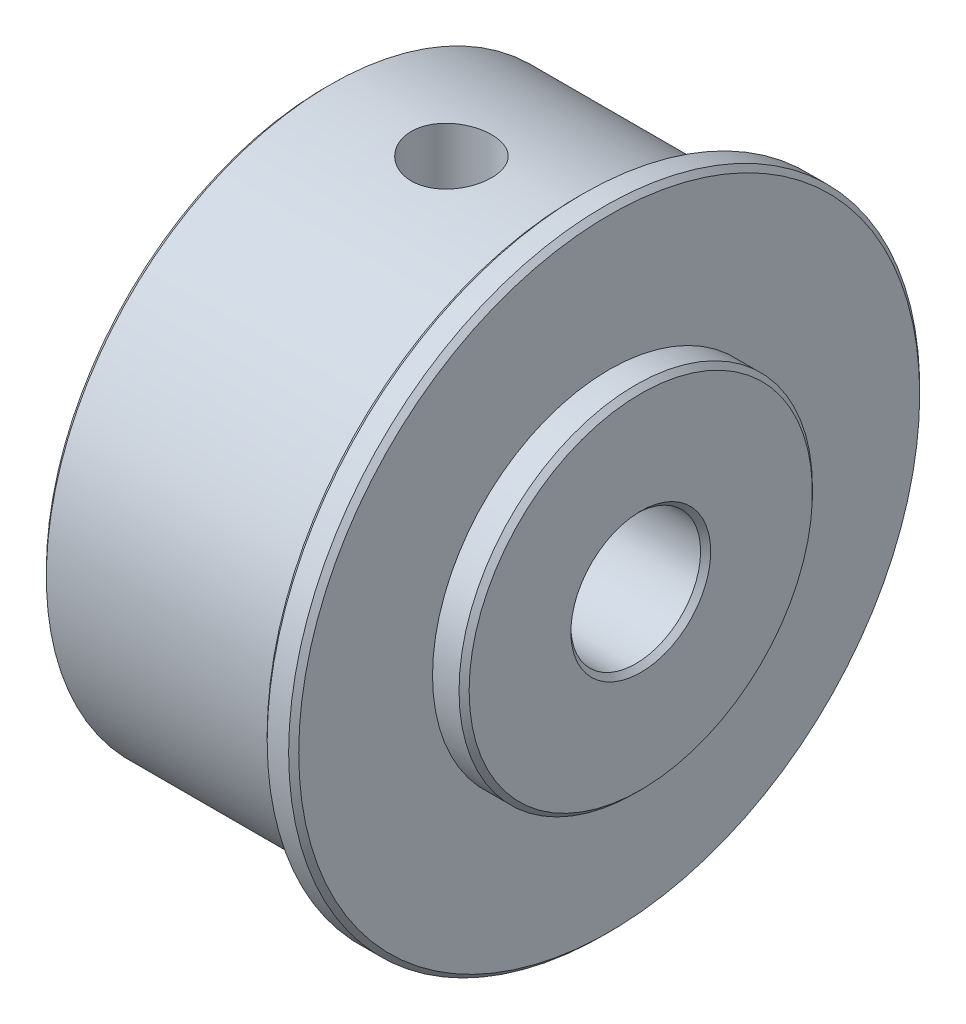
ISO-10303-21;
HEADER;
FILE_DESCRIPTION(('STEP AP214'),'2;1');
FILE_NAME('part.step','',(''),(''),'','','');
FILE_SCHEMA(('AUTOMOTIVE_DESIGN { 1 0 10303 214 1 1 1 1 }'));
ENDSEC;
DATA;
#1=APPLICATION_CONTEXT('core data for automotive mechanical design processes');
#2=APPLICATION_PROTOCOL_DEFINITION('international standard','automotive_design',2000,#1);
#3=PRODUCT_CONTEXT('',#1,'mechanical');
#4=PRODUCT('Part','Part','',(#3));
#5=PRODUCT_RELATED_PRODUCT_CATEGORY('part','',(#4));
#6=PRODUCT_DEFINITION_FORMATION('','',#4);
#7=PRODUCT_DEFINITION_CONTEXT('part definition',#1,'design');
#8=PRODUCT_DEFINITION('design','',#6,#7);
#9=PRODUCT_DEFINITION_SHAPE('','',#8);
#10=(LENGTH_UNIT() NAMED_UNIT(*) SI_UNIT(.MILLI.,.METRE.));
#11=(NAMED_UNIT(*) PLANE_ANGLE_UNIT() SI_UNIT($,.RADIAN.));
#12=(NAMED_UNIT(*) SI_UNIT($,.STERADIAN.) SOLID_ANGLE_UNIT());
#13=UNCERTAINTY_MEASURE_WITH_UNIT(LENGTH_MEASURE(1.E-05),#10,'distance_accuracy_value','');
#14=(GEOMETRIC_REPRESENTATION_CONTEXT(3) GLOBAL_UNCERTAINTY_ASSIGNED_CONTEXT((#13)) GLOBAL_UNIT_ASSIGNED_CONTEXT((#10,
#11,#12)) REPRESENTATION_CONTEXT('',''));
#15=CARTESIAN_POINT('',(0.,0.,0.));
#16=DIRECTION('',(0.,0.,1.));
#17=DIRECTION('',(1.,0.,0.));
#18=AXIS2_PLACEMENT_3D('',#15,#16,#17);
#19=CARTESIAN_POINT('',(1.5875,0.,0.));
#20=DIRECTION('',(1.,0.,0.));
#21=DIRECTION('',(0.,0.,-1.));
#22=AXIS2_PLACEMENT_3D('',#19,#20,#21);
#23=PLANE('',#22);
#24=CARTESIAN_POINT('',(1.5875,0.,0.));
#25=DIRECTION('',(-1.,0.,0.));
#26=DIRECTION('',(0.,0.,1.));
#27=AXIS2_PLACEMENT_3D('',#24,#25,#26);
#28=CIRCLE('',#27,8.89);
#29=CARTESIAN_POINT('',(1.5875,0.,8.89));
#30=VERTEX_POINT('',#29);
#31=EDGE_CURVE('E19',#30,#30,#28,.F.);
#32=ORIENTED_EDGE('',*,*,#31,.F.);
#33=EDGE_LOOP('',(#32));
#34=FACE_BOUND('',#33,.T.);
#35=CARTESIAN_POINT('',(1.5875,0.,0.));
#36=DIRECTION('',(-1.,0.,0.));
#37=DIRECTION('',(0.,0.,1.));
#38=AXIS2_PLACEMENT_3D('',#35,#36,#37);
#39=CIRCLE('',#38,15.621);
#40=CARTESIAN_POINT('',(1.5875,0.,15.621));
#41=VERTEX_POINT('',#40);
#42=EDGE_CURVE('E61',#41,#41,#39,.T.);
#43=ORIENTED_EDGE('',*,*,#42,.F.);
#44=EDGE_LOOP('',(#43));
#45=FACE_BOUND('',#44,.T.);
#46=ADVANCED_FACE('F16',(#34,#45),#23,.T.);
#47=CARTESIAN_POINT('',(3.175,0.,0.));
#48=DIRECTION('',(-1.,0.,0.));
#49=DIRECTION('',(0.,0.,1.));
#50=AXIS2_PLACEMENT_3D('',#47,#48,#49);
#51=CYLINDRICAL_SURFACE('',#50,8.89);
#52=ORIENTED_EDGE('',*,*,#31,.T.);
#53=EDGE_LOOP('',(#52));
#54=FACE_BOUND('',#53,.T.);
#55=CARTESIAN_POINT('',(2.92100000000001,0.,0.));
#56=DIRECTION('',(-1.,0.,0.));
#57=DIRECTION('',(0.,0.,1.));
#58=AXIS2_PLACEMENT_3D('',#55,#56,#57);
#59=CIRCLE('',#58,8.89);
#60=CARTESIAN_POINT('',(2.92100000000001,0.,8.89));
#61=VERTEX_POINT('',#60);
#62=EDGE_CURVE('E59',#61,#61,#59,.F.);
#63=ORIENTED_EDGE('',*,*,#62,.F.);
#64=EDGE_LOOP('',(#63));
#65=FACE_BOUND('',#64,.T.);
#66=ADVANCED_FACE('F124',(#54,#65),#51,.T.);
#67=CARTESIAN_POINT('',(1.3335,0.,0.));
#68=DIRECTION('',(-1.,0.,0.));
#69=DIRECTION('',(0.,0.,1.));
#70=AXIS2_PLACEMENT_3D('',#67,#68,#69);
#71=CONICAL_SURFACE('',#70,15.875,0.785398163397447);
#72=ORIENTED_EDGE('',*,*,#42,.T.);
#73=EDGE_LOOP('',(#72));
#74=FACE_BOUND('',#73,.T.);
#75=CARTESIAN_POINT('',(1.3335,0.,0.));
#76=DIRECTION('',(-1.,0.,0.));
#77=DIRECTION('',(0.,0.,1.));
#78=AXIS2_PLACEMENT_3D('',#75,#76,#77);
#79=CIRCLE('',#78,15.875);
#80=CARTESIAN_POINT('',(1.3335,0.,15.875));
#81=VERTEX_POINT('',#80);
#82=EDGE_CURVE('E56',#81,#81,#79,.T.);
#83=ORIENTED_EDGE('',*,*,#82,.F.);
#84=EDGE_LOOP('',(#83));
#85=FACE_BOUND('',#84,.T.);
#86=ADVANCED_FACE('F121',(#74,#85),#71,.T.);
#87=CARTESIAN_POINT('',(2.92100000000001,0.,0.));
#88=DIRECTION('',(-1.,0.,0.));
#89=DIRECTION('',(0.,0.,1.));
#90=AXIS2_PLACEMENT_3D('',#87,#88,#89);
#91=CONICAL_SURFACE('',#90,8.89,0.785398163397449);
#92=ORIENTED_EDGE('',*,*,#62,.T.);
#93=EDGE_LOOP('',(#92));
#94=FACE_BOUND('',#93,.T.);
#95=CARTESIAN_POINT('',(3.175,0.,0.));
#96=DIRECTION('',(-1.,0.,0.));
#97=DIRECTION('',(0.,0.,1.));
#98=AXIS2_PLACEMENT_3D('',#95,#96,#97);
#99=CIRCLE('',#98,8.636);
#100=CARTESIAN_POINT('',(3.175,0.,8.636));
#101=VERTEX_POINT('',#100);
#102=EDGE_CURVE('E55',#101,#101,#99,.F.);
#103=ORIENTED_EDGE('',*,*,#102,.F.);
#104=EDGE_LOOP('',(#103));
#105=FACE_BOUND('',#104,.T.);
#106=ADVANCED_FACE('F117',(#94,#105),#91,.T.);
#107=CARTESIAN_POINT('',(1.5875,0.,0.));
#108=DIRECTION('',(-1.,0.,0.));
#109=DIRECTION('',(0.,0.,1.));
#110=AXIS2_PLACEMENT_3D('',#107,#108,#109);
#111=CYLINDRICAL_SURFACE('',#110,15.875);
#112=ORIENTED_EDGE('',*,*,#82,.T.);
#113=EDGE_LOOP('',(#112));
#114=FACE_BOUND('',#113,.T.);
#115=CARTESIAN_POINT('',(0.253999999999997,0.,0.));
#116=DIRECTION('',(1.,0.,0.));
#117=DIRECTION('',(0.,0.,-1.));
#118=AXIS2_PLACEMENT_3D('',#115,#116,#117);
#119=CIRCLE('',#118,15.875);
#120=CARTESIAN_POINT('',(0.253999999999997,0.,-15.875));
#121=VERTEX_POINT('',#120);
#122=EDGE_CURVE('E48',#121,#121,#119,.F.);
#123=ORIENTED_EDGE('',*,*,#122,.F.);
#124=EDGE_LOOP('',(#123));
#125=FACE_BOUND('',#124,.T.);
#126=ADVANCED_FACE('F113',(#114,#125),#111,.T.);
#127=CARTESIAN_POINT('',(3.175,0.,0.));
#128=DIRECTION('',(1.,0.,0.));
#129=DIRECTION('',(0.,0.,-1.));
#130=AXIS2_PLACEMENT_3D('',#127,#128,#129);
#131=PLANE('',#130);
#132=ORIENTED_EDGE('',*,*,#102,.T.);
#133=EDGE_LOOP('',(#132));
#134=FACE_BOUND('',#133,.T.);
#135=CARTESIAN_POINT('',(3.17500000005566,0.,0.));
#136=DIRECTION('',(1.,0.,0.));
#137=DIRECTION('',(0.,0.,-1.));
#138=AXIS2_PLACEMENT_3D('',#135,#136,#137);
#139=CIRCLE('',#138,3.51790000001984);
#140=CARTESIAN_POINT('',(3.17500000005566,0.,-3.51790000001984));
#141=VERTEX_POINT('',#140);
#142=EDGE_CURVE('E42',#141,#141,#139,.F.);
#143=ORIENTED_EDGE('',*,*,#142,.T.);
#144=EDGE_LOOP('',(#143));
#145=FACE_BOUND('',#144,.T.);
#146=ADVANCED_FACE('F35',(#134,#145),#131,.T.);
#147=CARTESIAN_POINT('',(-6.35,6.33729999992738,0.));
#148=DIRECTION('',(0.,1.,0.));
#149=DIRECTION('',(0.,0.,1.));
#150=AXIS2_PLACEMENT_3D('',#147,#148,#149);
#151=CONICAL_SURFACE('',#150,2.0192999998585,1.02974425857673);
#152=CARTESIAN_POINT('',(-6.35,5.12398215195731,5.68441965115255E-11));
#153=VERTEX_POINT('',#152);
#154=VERTEX_LOOP('',#153);
#155=FACE_BOUND('',#154,.T.);
#156=CARTESIAN_POINT('',(-6.35,6.3373,0.));
#157=DIRECTION('',(0.,1.,0.));
#158=DIRECTION('',(0.,0.,1.));
#159=AXIS2_PLACEMENT_3D('',#156,#157,#158);
#160=CIRCLE('',#159,2.01929999999999);
#161=CARTESIAN_POINT('',(-6.35,6.3373,2.01929999999999));
#162=VERTEX_POINT('',#161);
#163=EDGE_CURVE('E39',#162,#162,#160,.T.);
#164=ORIENTED_EDGE('',*,*,#163,.T.);
#165=EDGE_LOOP('',(#164));
#166=FACE_BOUND('',#165,.T.);
#167=ADVANCED_FACE('F31',(#155,#166),#151,.F.);
#168=CARTESIAN_POINT('',(0.253999999999997,0.,0.));
#169=DIRECTION('',(1.,0.,0.));
#170=DIRECTION('',(0.,0.,-1.));
#171=AXIS2_PLACEMENT_3D('',#168,#169,#170);
#172=CONICAL_SURFACE('',#171,15.875,0.785398163397462);
#173=CARTESIAN_POINT('',(0.,0.,0.));
#174=DIRECTION('',(1.,0.,0.));
#175=DIRECTION('',(0.,0.,-1.));
#176=AXIS2_PLACEMENT_3D('',#173,#174,#175);
#177=CIRCLE('',#176,15.621);
#178=CARTESIAN_POINT('',(0.,0.,-15.621));
#179=VERTEX_POINT('',#178);
#180=EDGE_CURVE('E41',#179,#179,#177,.T.);
#181=ORIENTED_EDGE('',*,*,#180,.T.);
#182=EDGE_LOOP('',(#181));
#183=FACE_BOUND('',#182,.T.);
#184=ORIENTED_EDGE('',*,*,#122,.T.);
#185=EDGE_LOOP('',(#184));
#186=FACE_BOUND('',#185,.T.);
#187=ADVANCED_FACE('F34',(#183,#186),#172,.T.);
#188=CARTESIAN_POINT('',(-6.35,-6.33729999992738,0.));
#189=DIRECTION('',(0.,-1.,0.));
#190=DIRECTION('',(0.,0.,-1.));
#191=AXIS2_PLACEMENT_3D('',#188,#189,#190);
#192=CONICAL_SURFACE('',#191,2.0192999998585,1.02974425857673);
#193=CARTESIAN_POINT('',(-6.35,-5.12398215195731,-5.68426412100906E-11));
#194=VERTEX_POINT('',#193);
#195=VERTEX_LOOP('',#194);
#196=FACE_BOUND('',#195,.T.);
#197=CARTESIAN_POINT('',(-6.35,-6.3373,0.));
#198=DIRECTION('',(0.,-1.,0.));
#199=DIRECTION('',(0.,0.,-1.));
#200=AXIS2_PLACEMENT_3D('',#197,#198,#199);
#201=CIRCLE('',#200,2.01929999999999);
#202=CARTESIAN_POINT('',(-6.35,-6.3373,-2.01929999999999));
#203=VERTEX_POINT('',#202);
#204=EDGE_CURVE('E45',#203,#203,#201,.T.);
#205=ORIENTED_EDGE('',*,*,#204,.T.);
#206=EDGE_LOOP('',(#205));
#207=FACE_BOUND('',#206,.T.);
#208=ADVANCED_FACE('F104',(#196,#207),#192,.F.);
#209=CARTESIAN_POINT('',(3.17500000005566,0.,0.));
#210=DIRECTION('',(1.,0.,0.));
#211=DIRECTION('',(0.,0.,-1.));
#212=AXIS2_PLACEMENT_3D('',#209,#210,#211);
#213=CONICAL_SURFACE('',#212,3.51790000001984,0.785398163285552);
#214=ORIENTED_EDGE('',*,*,#142,.F.);
#215=EDGE_LOOP('',(#214));
#216=FACE_BOUND('',#215,.T.);
#217=CARTESIAN_POINT('',(2.921,0.,0.));
#218=DIRECTION('',(1.,0.,0.));
#219=DIRECTION('',(0.,0.,-1.));
#220=AXIS2_PLACEMENT_3D('',#217,#218,#219);
#221=CIRCLE('',#220,3.2639);
#222=CARTESIAN_POINT('',(2.921,0.,-3.2639));
#223=VERTEX_POINT('',#222);
#224=EDGE_CURVE('E94',#223,#223,#221,.F.);
#225=ORIENTED_EDGE('',*,*,#224,.T.);
#226=EDGE_LOOP('',(#225));
#227=FACE_BOUND('',#226,.T.);
#228=ADVANCED_FACE('F100',(#216,#227),#213,.F.);
#229=CARTESIAN_POINT('',(-6.35,14.2875,0.));
#230=DIRECTION('',(0.,1.,0.));
#231=DIRECTION('',(0.,0.,1.));
#232=AXIS2_PLACEMENT_3D('',#229,#230,#231);
#233=CYLINDRICAL_SURFACE('',#232,2.01929999999999);
#234=CARTESIAN_POINT('',(-6.35,14.144082994666,2.01929999999999));
#235=CARTESIAN_POINT('',(-6.46270978043252,14.1440848572454,2.01929494830352));
#236=CARTESIAN_POINT('',(-6.57556587894467,14.1454458805024,2.00982386080186));
#237=CARTESIAN_POINT('',(-6.7982088924763,14.1507430375104,1.97217534297388));
#238=CARTESIAN_POINT('',(-6.90798898861305,14.1546844828974,1.94395932562443));
#239=CARTESIAN_POINT('',(-7.12110470893202,14.1646874218911,1.8696741044343));
#240=CARTESIAN_POINT('',(-7.22444753490229,14.1707464942905,1.82362528341692));
#241=CARTESIAN_POINT('',(-7.42189406589666,14.1842985714464,1.71502478847225));
#242=CARTESIAN_POINT('',(-7.51600143849081,14.1917910034744,1.6524797022028));
#243=CARTESIAN_POINT('',(-7.69303462417489,14.2074272342722,1.51217328150928));
#244=CARTESIAN_POINT('',(-7.77588421230663,14.2155749310997,1.43431618488559));
#245=CARTESIAN_POINT('',(-7.92739205174378,14.2315690971988,1.2657989315602));
#246=CARTESIAN_POINT('',(-7.99604883392367,14.2394155352181,1.17513745108457));
#247=CARTESIAN_POINT('',(-8.11749018201473,14.2539623529557,0.983112202140053));
#248=CARTESIAN_POINT('',(-8.1702063573829,14.2606577427863,0.881704771543284));
#249=CARTESIAN_POINT('',(-8.25783082400248,14.2721058154367,0.671365971979825));
#250=CARTESIAN_POINT('',(-8.29274010812396,14.2768586065682,0.56243502289132));
#251=CARTESIAN_POINT('',(-8.34353419968075,14.2838590054793,0.340911595459712));
#252=CARTESIAN_POINT('',(-8.35954437028774,14.28612311441,0.228348392070305));
#253=CARTESIAN_POINT('',(-8.37247474096552,14.2879475293366,0.00211168387442576));
#254=CARTESIAN_POINT('',(-8.36939585590122,14.2875079649092,-0.111561767461443));
#255=CARTESIAN_POINT('',(-8.34433505905639,14.2839878101692,-0.335936542663665));
#256=CARTESIAN_POINT('',(-8.32248816809108,14.2809260846932,-0.446653285103087));
#257=CARTESIAN_POINT('',(-8.26072280300443,14.272526639762,-0.662834215513372));
#258=CARTESIAN_POINT('',(-8.2208037520711,14.2671888476616,-0.768298235713001));
#259=CARTESIAN_POINT('',(-8.12388550625377,14.2548043308748,-0.971394358653125));
#260=CARTESIAN_POINT('',(-8.06682832552566,14.247751820225,-1.06899842301094));
#261=CARTESIAN_POINT('',(-7.93730058817926,14.2327257552402,-1.25328969037924));
#262=CARTESIAN_POINT('',(-7.86483035509148,14.2247522202398,-1.3399771224765));
#263=CARTESIAN_POINT('',(-7.70579446431181,14.2086932563854,-1.5007629286406));
#264=CARTESIAN_POINT('',(-7.61911362555077,14.200607453654,-1.57474736975061));
#265=CARTESIAN_POINT('',(-7.43445909511833,14.1852981969896,-1.70717057678363));
#266=CARTESIAN_POINT('',(-7.3364802927051,14.1780751363578,-1.76560226741946));
#267=CARTESIAN_POINT('',(-7.13187256086239,14.1653086919635,-1.8652679033142));
#268=CARTESIAN_POINT('',(-7.02523133128519,14.1597677514924,-1.90647686483089));
#269=CARTESIAN_POINT('',(-6.80658871275593,14.1510314499486,-1.97028383212601));
#270=CARTESIAN_POINT('',(-6.69459920164276,14.1478311271646,-1.99292121896487));
#271=CARTESIAN_POINT('',(-6.5431885987086,14.1453494339129,-2.0104117344966));
#272=CARTESIAN_POINT('',(-6.5046324531641,14.1448755243254,-2.0137422538627));
#273=CARTESIAN_POINT('',(-6.42738995630406,14.1442419848102,-2.01818725463624));
#274=CARTESIAN_POINT('',(-6.38870360491022,14.1440823550717,-2.01930173471071));
#275=CARTESIAN_POINT('',(-6.23729021956748,14.1440848572454,-2.01929494830352));
#276=CARTESIAN_POINT('',(-6.12443412105533,14.1454458805024,-2.00982386080186));
#277=CARTESIAN_POINT('',(-5.9017911075237,14.1507430375104,-1.97217534297388));
#278=CARTESIAN_POINT('',(-5.79201101138695,14.1546844828974,-1.94395932562443));
#279=CARTESIAN_POINT('',(-5.57889529106798,14.1646874218911,-1.86967410443429));
#280=CARTESIAN_POINT('',(-5.47555246509771,14.1707464942905,-1.82362528341692));
#281=CARTESIAN_POINT('',(-5.27810593410334,14.1842985714464,-1.71502478847225));
#282=CARTESIAN_POINT('',(-5.18399856150919,14.1917910034744,-1.6524797022028));
#283=CARTESIAN_POINT('',(-5.00696537582511,14.2074272342722,-1.51217328150928));
#284=CARTESIAN_POINT('',(-4.92411578769338,14.2155749310997,-1.43431618488559));
#285=CARTESIAN_POINT('',(-4.77260794825623,14.2315690971988,-1.26579893156019));
#286=CARTESIAN_POINT('',(-4.70395116607633,14.2394155352181,-1.17513745108457));
#287=CARTESIAN_POINT('',(-4.58250981798527,14.2539623529557,-0.983112202140051));
#288=CARTESIAN_POINT('',(-4.5297936426171,14.2606577427863,-0.881704771543283));
#289=CARTESIAN_POINT('',(-4.44216917599753,14.2721058154367,-0.671365971979824));
#290=CARTESIAN_POINT('',(-4.40725989187604,14.2768586065682,-0.562435022891319));
#291=CARTESIAN_POINT('',(-4.35646580031926,14.2838590054793,-0.34091159545971));
#292=CARTESIAN_POINT('',(-4.34045562971226,14.28612311441,-0.228348392070304));
#293=CARTESIAN_POINT('',(-4.32752525903448,14.2879475293366,-0.00211168387442461));
#294=CARTESIAN_POINT('',(-4.33060414409879,14.2875079649092,0.111561767461445));
#295=CARTESIAN_POINT('',(-4.35566494094361,14.2839878101692,0.335936542663667));
#296=CARTESIAN_POINT('',(-4.37751183190892,14.2809260846932,0.446653285103088));
#297=CARTESIAN_POINT('',(-4.43927719699557,14.272526639762,0.662834215513374));
#298=CARTESIAN_POINT('',(-4.4791962479289,14.2671888476616,0.768298235713002));
#299=CARTESIAN_POINT('',(-4.57611449374623,14.2548043308748,0.971394358653127));
#300=CARTESIAN_POINT('',(-4.63317167447434,14.247751820225,1.06899842301094));
#301=CARTESIAN_POINT('',(-4.76269941182075,14.2327257552402,1.25328969037924));
#302=CARTESIAN_POINT('',(-4.83516964490852,14.2247522202398,1.3399771224765));
#303=CARTESIAN_POINT('',(-4.99420553568819,14.2086932563854,1.5007629286406));
#304=CARTESIAN_POINT('',(-5.08088637444923,14.200607453654,1.57474736975061));
#305=CARTESIAN_POINT('',(-5.26554090488167,14.1852981969896,1.70717057678363));
#306=CARTESIAN_POINT('',(-5.3635197072949,14.1780751363578,1.76560226741946));
#307=CARTESIAN_POINT('',(-5.56812743913762,14.1653086919635,1.8652679033142));
#308=CARTESIAN_POINT('',(-5.67476866871481,14.1597677514924,1.90647686483089));
#309=CARTESIAN_POINT('',(-5.89341128724408,14.1510314499486,1.97028383212602));
#310=CARTESIAN_POINT('',(-6.00540079835724,14.1478311271646,1.99292121896487));
#311=CARTESIAN_POINT('',(-6.1568114012914,14.1453494339129,2.01041173449661));
#312=CARTESIAN_POINT('',(-6.19536754683591,14.1448755243254,2.0137422538627));
#313=CARTESIAN_POINT('',(-6.27261004369595,14.1442419848102,2.01818725463624));
#314=CARTESIAN_POINT('',(-6.31129639508978,14.1440823550717,2.01930173471071));
#315=CARTESIAN_POINT('',(-6.35,14.144082994666,2.01929999999999));
#316=B_SPLINE_CURVE_WITH_KNOTS('',3,(#234,#235,#236,#237,#238,#239,#240,#241,#242,#243,#244,
#245,#246,#247,#248,#249,#250,#251,#252,#253,#254,#255,#256,#257,#258,#259,#260,#261,#262,#263,
#264,#265,#266,#267,#268,#269,#270,#271,#272,#273,#274,#275,#276,#277,#278,#279,#280,#281,#282,
#283,#284,#285,#286,#287,#288,#289,#290,#291,#292,#293,#294,#295,#296,#297,#298,#299,#300,#301,
#302,#303,#304,#305,#306,#307,#308,#309,#310,#311,#312,#313,#314,#315),.UNSPECIFIED.,.T.,.F.,(4,
2,2,2,2,2,2,2,2,2,2,2,2,2,2,2,2,2,2,2,2,2,2,2,2,2,2,2,2,2,2,2,2,2,2,2,2,2,2,2,4),(0.,
0.337981725405059,0.676661361564413,1.01495502540221,1.35311379825344,1.69345884511455,
2.03383910414603,2.37565963920306,2.71746111307282,3.05698234773836,3.39648731058473,
3.73357006716555,4.07066358322854,4.40891073452933,4.74715078649165,5.08828181598833,
5.42956776925377,5.77134709676019,6.11239979348321,6.22845984832776,6.34451997298378,
6.68250169838884,7.0211813345482,7.35947499838599,7.69763377123723,8.03797881809834,
8.37835907712982,8.72017961218684,9.0619810860566,9.40150232072215,9.74100728356851,
10.0780900401493,10.4151835562123,10.7534307075131,11.0916707594754,11.4328017889721,
11.7740877422376,12.115867069744,12.456919766467,12.5729798213115,12.6890399459676),.UNSPECIFIED.);
#317=CARTESIAN_POINT('',(-6.35,14.144082994666,2.01929999999999));
#318=VERTEX_POINT('',#317);
#319=EDGE_CURVE('E89',#318,#318,#316,.T.);
#320=ORIENTED_EDGE('',*,*,#319,.F.);
#321=EDGE_LOOP('',(#320));
#322=FACE_BOUND('',#321,.T.);
#323=ORIENTED_EDGE('',*,*,#163,.F.);
#324=EDGE_LOOP('',(#323));
#325=FACE_BOUND('',#324,.T.);
#326=ADVANCED_FACE('F95',(#322,#325),#233,.F.);
#327=CARTESIAN_POINT('',(0.,0.,0.));
#328=DIRECTION('',(1.,0.,0.));
#329=DIRECTION('',(0.,0.,-1.));
#330=AXIS2_PLACEMENT_3D('',#327,#328,#329);
#331=PLANE('',#330);
#332=CARTESIAN_POINT('',(0.,0.,0.));
#333=DIRECTION('',(1.,0.,0.));
#334=DIRECTION('',(0.,0.,-1.));
#335=AXIS2_PLACEMENT_3D('',#332,#333,#334);
#336=CIRCLE('',#335,14.2875);
#337=CARTESIAN_POINT('',(0.,0.,-14.2875));
#338=VERTEX_POINT('',#337);
#339=EDGE_CURVE('E74',#338,#338,#336,.F.);
#340=ORIENTED_EDGE('',*,*,#339,.F.);
#341=EDGE_LOOP('',(#340));
#342=FACE_BOUND('',#341,.T.);
#343=ORIENTED_EDGE('',*,*,#180,.F.);
#344=EDGE_LOOP('',(#343));
#345=FACE_BOUND('',#344,.T.);
#346=ADVANCED_FACE('F99',(#342,#345),#331,.F.);
#347=CARTESIAN_POINT('',(-6.35,-14.2875,0.));
#348=DIRECTION('',(0.,-1.,0.));
#349=DIRECTION('',(0.,0.,-1.));
#350=AXIS2_PLACEMENT_3D('',#347,#348,#349);
#351=CYLINDRICAL_SURFACE('',#350,2.01929999999999);
#352=CARTESIAN_POINT('',(-6.35,-14.144082994666,-2.01929999999999));
#353=CARTESIAN_POINT('',(-6.46270978043252,-14.1440848572454,-2.01929494830352));
#354=CARTESIAN_POINT('',(-6.57556587894467,-14.1454458805024,-2.00982386080186));
#355=CARTESIAN_POINT('',(-6.7982088924763,-14.1507430375104,-1.97217534297388));
#356=CARTESIAN_POINT('',(-6.90798898861305,-14.1546844828974,-1.94395932562443));
#357=CARTESIAN_POINT('',(-7.12110470893202,-14.1646874218911,-1.86967410443429));
#358=CARTESIAN_POINT('',(-7.22444753490229,-14.1707464942905,-1.82362528341692));
#359=CARTESIAN_POINT('',(-7.42189406589667,-14.1842985714464,-1.71502478847225));
#360=CARTESIAN_POINT('',(-7.51600143849081,-14.1917910034744,-1.6524797022028));
#361=CARTESIAN_POINT('',(-7.69303462417489,-14.2074272342722,-1.51217328150928));
#362=CARTESIAN_POINT('',(-7.77588421230663,-14.2155749310997,-1.43431618488559));
#363=CARTESIAN_POINT('',(-7.92739205174378,-14.2315690971988,-1.26579893156019));
#364=CARTESIAN_POINT('',(-7.99604883392367,-14.2394155352181,-1.17513745108457));
#365=CARTESIAN_POINT('',(-8.11749018201473,-14.2539623529557,-0.983112202140051));
#366=CARTESIAN_POINT('',(-8.1702063573829,-14.2606577427863,-0.881704771543283));
#367=CARTESIAN_POINT('',(-8.25783082400248,-14.2721058154367,-0.671365971979823));
#368=CARTESIAN_POINT('',(-8.29274010812396,-14.2768586065682,-0.562435022891318));
#369=CARTESIAN_POINT('',(-8.34353419968075,-14.2838590054793,-0.34091159545971));
#370=CARTESIAN_POINT('',(-8.35954437028774,-14.28612311441,-0.228348392070303));
#371=CARTESIAN_POINT('',(-8.37247474096552,-14.2879475293366,-0.00211168387442444));
#372=CARTESIAN_POINT('',(-8.36939585590122,-14.2875079649092,0.111561767461445));
#373=CARTESIAN_POINT('',(-8.34433505905639,-14.2839878101692,0.335936542663667));
#374=CARTESIAN_POINT('',(-8.32248816809108,-14.2809260846932,0.446653285103089));
#375=CARTESIAN_POINT('',(-8.26072280300443,-14.272526639762,0.662834215513374));
#376=CARTESIAN_POINT('',(-8.2208037520711,-14.2671888476616,0.768298235713002));
#377=CARTESIAN_POINT('',(-8.12388550625377,-14.2548043308748,0.971394358653127));
#378=CARTESIAN_POINT('',(-8.06682832552566,-14.247751820225,1.06899842301094));
#379=CARTESIAN_POINT('',(-7.93730058817926,-14.2327257552402,1.25328969037924));
#380=CARTESIAN_POINT('',(-7.86483035509148,-14.2247522202398,1.3399771224765));
#381=CARTESIAN_POINT('',(-7.70579446431181,-14.2086932563854,1.5007629286406));
#382=CARTESIAN_POINT('',(-7.61911362555077,-14.200607453654,1.57474736975061));
#383=CARTESIAN_POINT('',(-7.43445909511833,-14.1852981969896,1.70717057678363));
#384=CARTESIAN_POINT('',(-7.3364802927051,-14.1780751363578,1.76560226741946));
#385=CARTESIAN_POINT('',(-7.13187256086239,-14.1653086919635,1.8652679033142));
#386=CARTESIAN_POINT('',(-7.02523133128519,-14.1597677514924,1.90647686483089));
#387=CARTESIAN_POINT('',(-6.80658871275593,-14.1510314499486,1.97028383212602));
#388=CARTESIAN_POINT('',(-6.69459920164276,-14.1478311271646,1.99292121896487));
#389=CARTESIAN_POINT('',(-6.5431885987086,-14.1453494339129,2.01041173449661));
#390=CARTESIAN_POINT('',(-6.5046324531641,-14.1448755243254,2.0137422538627));
#391=CARTESIAN_POINT('',(-6.42738995630406,-14.1442419848102,2.01818725463624));
#392=CARTESIAN_POINT('',(-6.38870360491022,-14.1440823550717,2.01930173471071));
#393=CARTESIAN_POINT('',(-6.23729021956748,-14.1440848572454,2.01929494830352));
#394=CARTESIAN_POINT('',(-6.12443412105533,-14.1454458805024,2.00982386080186));
#395=CARTESIAN_POINT('',(-5.9017911075237,-14.1507430375104,1.97217534297388));
#396=CARTESIAN_POINT('',(-5.79201101138695,-14.1546844828974,1.94395932562443));
#397=CARTESIAN_POINT('',(-5.57889529106798,-14.1646874218911,1.8696741044343));
#398=CARTESIAN_POINT('',(-5.47555246509771,-14.1707464942905,1.82362528341692));
#399=CARTESIAN_POINT('',(-5.27810593410334,-14.1842985714464,1.71502478847225));
#400=CARTESIAN_POINT('',(-5.18399856150919,-14.1917910034744,1.6524797022028));
#401=CARTESIAN_POINT('',(-5.00696537582511,-14.2074272342722,1.51217328150928));
#402=CARTESIAN_POINT('',(-4.92411578769338,-14.2155749310997,1.43431618488559));
#403=CARTESIAN_POINT('',(-4.77260794825623,-14.2315690971988,1.2657989315602));
#404=CARTESIAN_POINT('',(-4.70395116607633,-14.2394155352181,1.17513745108457));
#405=CARTESIAN_POINT('',(-4.58250981798527,-14.2539623529557,0.983112202140052));
#406=CARTESIAN_POINT('',(-4.5297936426171,-14.2606577427863,0.881704771543284));
#407=CARTESIAN_POINT('',(-4.44216917599753,-14.2721058154367,0.671365971979824));
#408=CARTESIAN_POINT('',(-4.40725989187604,-14.2768586065682,0.56243502289132));
#409=CARTESIAN_POINT('',(-4.35646580031926,-14.2838590054793,0.340911595459712));
#410=CARTESIAN_POINT('',(-4.34045562971226,-14.28612311441,0.228348392070305));
#411=CARTESIAN_POINT('',(-4.32752525903448,-14.2879475293366,0.00211168387442539));
#412=CARTESIAN_POINT('',(-4.33060414409879,-14.2875079649092,-0.111561767461444));
#413=CARTESIAN_POINT('',(-4.35566494094361,-14.2839878101692,-0.335936542663665));
#414=CARTESIAN_POINT('',(-4.37751183190892,-14.2809260846932,-0.446653285103088));
#415=CARTESIAN_POINT('',(-4.43927719699557,-14.272526639762,-0.662834215513373));
#416=CARTESIAN_POINT('',(-4.4791962479289,-14.2671888476616,-0.768298235713001));
#417=CARTESIAN_POINT('',(-4.57611449374623,-14.2548043308748,-0.971394358653126));
#418=CARTESIAN_POINT('',(-4.63317167447435,-14.247751820225,-1.06899842301094));
#419=CARTESIAN_POINT('',(-4.76269941182075,-14.2327257552402,-1.25328969037924));
#420=CARTESIAN_POINT('',(-4.83516964490853,-14.2247522202398,-1.3399771224765));
#421=CARTESIAN_POINT('',(-4.9942055356882,-14.2086932563854,-1.5007629286406));
#422=CARTESIAN_POINT('',(-5.08088637444924,-14.200607453654,-1.57474736975061));
#423=CARTESIAN_POINT('',(-5.26554090488167,-14.1852981969896,-1.70717057678363));
#424=CARTESIAN_POINT('',(-5.3635197072949,-14.1780751363578,-1.76560226741946));
#425=CARTESIAN_POINT('',(-5.56812743913762,-14.1653086919635,-1.8652679033142));
#426=CARTESIAN_POINT('',(-5.67476866871481,-14.1597677514924,-1.90647686483089));
#427=CARTESIAN_POINT('',(-5.89341128724408,-14.1510314499486,-1.97028383212601));
#428=CARTESIAN_POINT('',(-6.00540079835725,-14.1478311271646,-1.99292121896487));
#429=CARTESIAN_POINT('',(-6.1568114012914,-14.1453494339129,-2.01041173449661));
#430=CARTESIAN_POINT('',(-6.19536754683591,-14.1448755243254,-2.0137422538627));
#431=CARTESIAN_POINT('',(-6.27261004369595,-14.1442419848102,-2.01818725463624));
#432=CARTESIAN_POINT('',(-6.31129639508978,-14.1440823550717,-2.01930173471071));
#433=CARTESIAN_POINT('',(-6.35,-14.144082994666,-2.01929999999999));
#434=B_SPLINE_CURVE_WITH_KNOTS('',3,(#352,#353,#354,#355,#356,#357,#358,#359,#360,#361,#362,
#363,#364,#365,#366,#367,#368,#369,#370,#371,#372,#373,#374,#375,#376,#377,#378,#379,#380,#381,
#382,#383,#384,#385,#386,#387,#388,#389,#390,#391,#392,#393,#394,#395,#396,#397,#398,#399,#400,
#401,#402,#403,#404,#405,#406,#407,#408,#409,#410,#411,#412,#413,#414,#415,#416,#417,#418,#419,
#420,#421,#422,#423,#424,#425,#426,#427,#428,#429,#430,#431,#432,#433),.UNSPECIFIED.,.T.,.F.,(4,
2,2,2,2,2,2,2,2,2,2,2,2,2,2,2,2,2,2,2,2,2,2,2,2,2,2,2,2,2,2,2,2,2,2,2,2,2,2,2,4),(0.,
0.337981725405059,0.676661361564413,1.01495502540221,1.35311379825344,1.69345884511455,
2.03383910414603,2.37565963920306,2.71746111307282,3.05698234773836,3.39648731058473,
3.73357006716555,4.07066358322854,4.40891073452933,4.74715078649165,5.08828181598833,
5.42956776925378,5.77134709676019,6.11239979348322,6.22845984832776,6.34451997298379,
6.68250169838884,7.0211813345482,7.359474998386,7.69763377123723,8.03797881809834,
8.37835907712982,8.72017961218684,9.0619810860566,9.40150232072215,9.74100728356851,
10.0780900401493,10.4151835562123,10.7534307075131,11.0916707594754,11.4328017889721,
11.7740877422376,12.115867069744,12.456919766467,12.5729798213115,12.6890399459676),.UNSPECIFIED.);
#435=CARTESIAN_POINT('',(-6.35,-14.144082994666,-2.01929999999999));
#436=VERTEX_POINT('',#435);
#437=EDGE_CURVE('E66',#436,#436,#434,.T.);
#438=ORIENTED_EDGE('',*,*,#437,.F.);
#439=EDGE_LOOP('',(#438));
#440=FACE_BOUND('',#439,.T.);
#441=ORIENTED_EDGE('',*,*,#204,.F.);
#442=EDGE_LOOP('',(#441));
#443=FACE_BOUND('',#442,.T.);
#444=ADVANCED_FACE('F76',(#440,#443),#351,.F.);
#445=CARTESIAN_POINT('',(3.175,0.,0.));
#446=DIRECTION('',(1.,0.,0.));
#447=DIRECTION('',(0.,0.,-1.));
#448=AXIS2_PLACEMENT_3D('',#445,#446,#447);
#449=CYLINDRICAL_SURFACE('',#448,3.2639);
#450=ORIENTED_EDGE('',*,*,#224,.F.);
#451=EDGE_LOOP('',(#450));
#452=FACE_BOUND('',#451,.T.);
#453=CARTESIAN_POINT('',(-12.4459999999544,0.,0.));
#454=DIRECTION('',(-1.,0.,0.));
#455=DIRECTION('',(0.,0.,1.));
#456=AXIS2_PLACEMENT_3D('',#453,#454,#455);
#457=CIRCLE('',#456,3.263899999979);
#458=CARTESIAN_POINT('',(-12.4459999999544,0.,3.263899999979));
#459=VERTEX_POINT('',#458);
#460=EDGE_CURVE('E73',#459,#459,#457,.T.);
#461=ORIENTED_EDGE('',*,*,#460,.T.);
#462=EDGE_LOOP('',(#461));
#463=FACE_BOUND('',#462,.T.);
#464=ADVANCED_FACE('F85',(#452,#463),#449,.F.);
#465=CARTESIAN_POINT('',(-12.7,0.,0.));
#466=DIRECTION('',(1.,0.,0.));
#467=DIRECTION('',(0.,0.,-1.));
#468=AXIS2_PLACEMENT_3D('',#465,#466,#467);
#469=CYLINDRICAL_SURFACE('',#468,14.2875);
#470=CARTESIAN_POINT('',(-12.446,0.,0.));
#471=DIRECTION('',(1.,0.,0.));
#472=DIRECTION('',(0.,0.,-1.));
#473=AXIS2_PLACEMENT_3D('',#470,#471,#472);
#474=CIRCLE('',#473,14.2875);
#475=CARTESIAN_POINT('',(-12.446,0.,-14.2875));
#476=VERTEX_POINT('',#475);
#477=EDGE_CURVE('E65',#476,#476,#474,.F.);
#478=ORIENTED_EDGE('',*,*,#477,.F.);
#479=EDGE_LOOP('',(#478));
#480=FACE_BOUND('',#479,.T.);
#481=ORIENTED_EDGE('',*,*,#437,.T.);
#482=EDGE_LOOP('',(#481));
#483=FACE_BOUND('',#482,.T.);
#484=ORIENTED_EDGE('',*,*,#339,.T.);
#485=EDGE_LOOP('',(#484));
#486=FACE_BOUND('',#485,.T.);
#487=ORIENTED_EDGE('',*,*,#319,.T.);
#488=EDGE_LOOP('',(#487));
#489=FACE_BOUND('',#488,.T.);
#490=ADVANCED_FACE('F80',(#480,#483,#486,#489),#469,.T.);
#491=CARTESIAN_POINT('',(-12.6999999999384,0.,0.));
#492=DIRECTION('',(-1.,0.,0.));
#493=DIRECTION('',(0.,-1.,0.));
#494=AXIS2_PLACEMENT_3D('',#491,#492,#493);
#495=CONICAL_SURFACE('',#494,3.51789999996299,0.785398163397448);
#496=CARTESIAN_POINT('',(-12.6999999999953,0.,0.));
#497=DIRECTION('',(-1.,0.,0.));
#498=DIRECTION('',(0.,-1.,0.));
#499=AXIS2_PLACEMENT_3D('',#496,#497,#498);
#500=CIRCLE('',#499,3.51790000001984);
#501=CARTESIAN_POINT('',(-12.6999999999953,-3.51790000001984,0.));
#502=VERTEX_POINT('',#501);
#503=EDGE_CURVE('E25',#502,#502,#500,.T.);
#504=ORIENTED_EDGE('',*,*,#503,.T.);
#505=EDGE_LOOP('',(#504));
#506=FACE_BOUND('',#505,.T.);
#507=ORIENTED_EDGE('',*,*,#460,.F.);
#508=EDGE_LOOP('',(#507));
#509=FACE_BOUND('',#508,.T.);
#510=ADVANCED_FACE('F84',(#506,#509),#495,.F.);
#511=CARTESIAN_POINT('',(-12.446,0.,0.));
#512=DIRECTION('',(1.,0.,0.));
#513=DIRECTION('',(0.,0.,-1.));
#514=AXIS2_PLACEMENT_3D('',#511,#512,#513);
#515=CONICAL_SURFACE('',#514,14.2875,0.785398163397455);
#516=CARTESIAN_POINT('',(-12.7,0.,0.));
#517=DIRECTION('',(1.,0.,0.));
#518=DIRECTION('',(0.,0.,-1.));
#519=AXIS2_PLACEMENT_3D('',#516,#517,#518);
#520=CIRCLE('',#519,14.0335);
#521=CARTESIAN_POINT('',(-12.7,0.,-14.0335));
#522=VERTEX_POINT('',#521);
#523=EDGE_CURVE('E9',#522,#522,#520,.T.);
#524=ORIENTED_EDGE('',*,*,#523,.T.);
#525=EDGE_LOOP('',(#524));
#526=FACE_BOUND('',#525,.T.);
#527=ORIENTED_EDGE('',*,*,#477,.T.);
#528=EDGE_LOOP('',(#527));
#529=FACE_BOUND('',#528,.T.);
#530=ADVANCED_FACE('F137',(#526,#529),#515,.T.);
#531=CARTESIAN_POINT('',(-12.7,0.,0.));
#532=DIRECTION('',(1.,0.,0.));
#533=DIRECTION('',(0.,0.,-1.));
#534=AXIS2_PLACEMENT_3D('',#531,#532,#533);
#535=PLANE('',#534);
#536=ORIENTED_EDGE('',*,*,#523,.F.);
#537=EDGE_LOOP('',(#536));
#538=FACE_BOUND('',#537,.T.);
#539=ORIENTED_EDGE('',*,*,#503,.F.);
#540=EDGE_LOOP('',(#539));
#541=FACE_BOUND('',#540,.T.);
#542=ADVANCED_FACE('F135',(#538,#541),#535,.F.);
#543=CLOSED_SHELL('',(#46,#66,#86,#106,#126,#146,#167,#187,#208,#228,#326,#346,#444,#464,#490,
#510,#530,#542));
#544=MANIFOLD_SOLID_BREP('B1',#543);
#545=ADVANCED_BREP_SHAPE_REPRESENTATION('',(#18,#544),#14);
#546=SHAPE_DEFINITION_REPRESENTATION(#9,#545);
ENDSEC;
END-ISO-10303-21;
